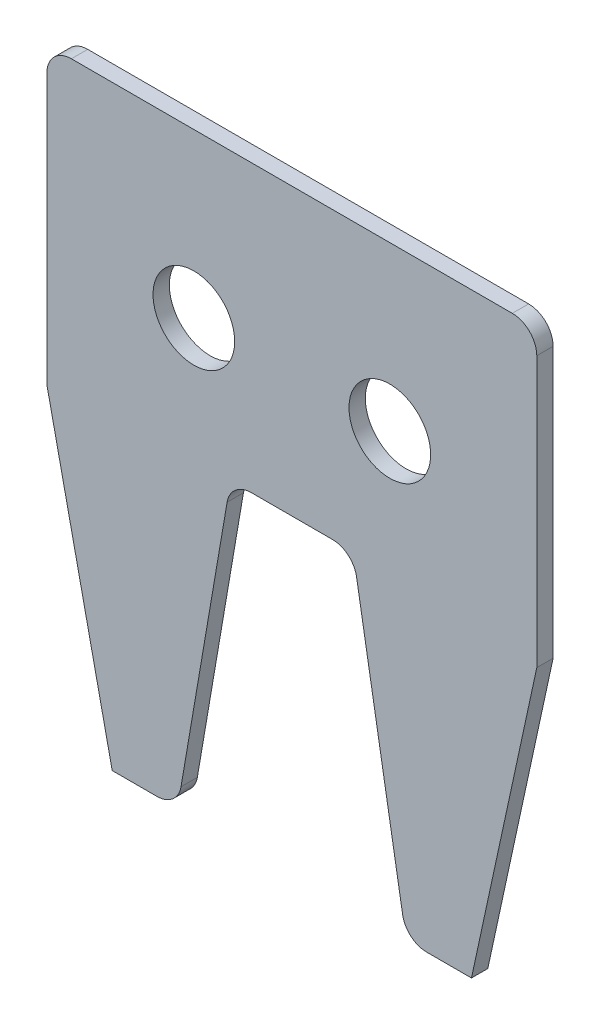
ISO-10303-21;
HEADER;
FILE_DESCRIPTION(('STEP AP214'),'2;1');
FILE_NAME('part.step','',(''),(''),'','','');
FILE_SCHEMA(('AUTOMOTIVE_DESIGN { 1 0 10303 214 1 1 1 1 }'));
ENDSEC;
DATA;
#1=APPLICATION_CONTEXT('core data for automotive mechanical design processes');
#2=APPLICATION_PROTOCOL_DEFINITION('international standard','automotive_design',2000,#1);
#3=PRODUCT_CONTEXT('',#1,'mechanical');
#4=PRODUCT('Part','Part','',(#3));
#5=PRODUCT_RELATED_PRODUCT_CATEGORY('part','',(#4));
#6=PRODUCT_DEFINITION_FORMATION('','',#4);
#7=PRODUCT_DEFINITION_CONTEXT('part definition',#1,'design');
#8=PRODUCT_DEFINITION('design','',#6,#7);
#9=PRODUCT_DEFINITION_SHAPE('','',#8);
#10=(LENGTH_UNIT() NAMED_UNIT(*) SI_UNIT(.MILLI.,.METRE.));
#11=(NAMED_UNIT(*) PLANE_ANGLE_UNIT() SI_UNIT($,.RADIAN.));
#12=(NAMED_UNIT(*) SI_UNIT($,.STERADIAN.) SOLID_ANGLE_UNIT());
#13=UNCERTAINTY_MEASURE_WITH_UNIT(LENGTH_MEASURE(1.E-05),#10,'distance_accuracy_value','');
#14=(GEOMETRIC_REPRESENTATION_CONTEXT(3) GLOBAL_UNCERTAINTY_ASSIGNED_CONTEXT((#13)) GLOBAL_UNIT_ASSIGNED_CONTEXT((#10,
#11,#12)) REPRESENTATION_CONTEXT('',''));
#15=CARTESIAN_POINT('',(0.,0.,0.));
#16=DIRECTION('',(0.,0.,1.));
#17=DIRECTION('',(1.,0.,0.));
#18=AXIS2_PLACEMENT_3D('',#15,#16,#17);
#19=CARTESIAN_POINT('',(-30.,-812.,32.));
#20=DIRECTION('',(0.,1.,0.));
#21=DIRECTION('',(0.,0.,1.));
#22=AXIS2_PLACEMENT_3D('',#19,#20,#21);
#23=PLANE('',#22);
#24=DIRECTION('',(1.,0.,0.));
#25=VECTOR('',#24,1.);
#26=CARTESIAN_POINT('',(-30.,-812.,30.));
#27=LINE('',#26,#25);
#28=CARTESIAN_POINT('',(-22.,-812.,30.));
#29=VERTEX_POINT('',#28);
#30=CARTESIAN_POINT('',(-16.5304141883476,-812.,30.));
#31=VERTEX_POINT('',#30);
#32=EDGE_CURVE('E166',#29,#31,#27,.T.);
#33=ORIENTED_EDGE('',*,*,#32,.T.);
#34=DIRECTION('',(0.,0.,1.));
#35=VECTOR('',#34,1.);
#36=CARTESIAN_POINT('',(-16.5304141883476,-812.,32.));
#37=LINE('',#36,#35);
#38=CARTESIAN_POINT('',(-16.5304141883476,-812.,32.));
#39=VERTEX_POINT('',#38);
#40=EDGE_CURVE('E207',#31,#39,#37,.T.);
#41=ORIENTED_EDGE('',*,*,#40,.T.);
#42=DIRECTION('',(1.,0.,0.));
#43=VECTOR('',#42,1.);
#44=CARTESIAN_POINT('',(-30.,-812.,32.));
#45=LINE('',#44,#43);
#46=CARTESIAN_POINT('',(-22.,-812.,32.));
#47=VERTEX_POINT('',#46);
#48=EDGE_CURVE('E169',#47,#39,#45,.T.);
#49=ORIENTED_EDGE('',*,*,#48,.F.);
#50=DIRECTION('',(0.,0.,1.));
#51=VECTOR('',#50,1.);
#52=CARTESIAN_POINT('',(-22.,-812.,-180.001));
#53=LINE('',#52,#51);
#54=EDGE_CURVE('E156',#29,#47,#53,.T.);
#55=ORIENTED_EDGE('',*,*,#54,.F.);
#56=EDGE_LOOP('',(#33,#41,#49,#55));
#57=FACE_BOUND('',#56,.T.);
#58=ADVANCED_FACE('F37',(#57),#23,.F.);
#59=CARTESIAN_POINT('',(30.,-812.,32.));
#60=DIRECTION('',(-1.,0.,0.));
#61=DIRECTION('',(0.,-1.,0.));
#62=AXIS2_PLACEMENT_3D('',#59,#60,#61);
#63=PLANE('',#62);
#64=DIRECTION('',(0.,1.,0.));
#65=VECTOR('',#64,1.);
#66=CARTESIAN_POINT('',(30.,-812.,30.));
#67=LINE('',#66,#65);
#68=CARTESIAN_POINT('',(30.,-775.076541071305,30.));
#69=VERTEX_POINT('',#68);
#70=CARTESIAN_POINT('',(30.,-742.,30.));
#71=VERTEX_POINT('',#70);
#72=EDGE_CURVE('E161',#69,#71,#67,.T.);
#73=ORIENTED_EDGE('',*,*,#72,.T.);
#74=DIRECTION('',(0.,0.,-1.));
#75=VECTOR('',#74,1.);
#76=CARTESIAN_POINT('',(30.,-742.,32.));
#77=LINE('',#76,#75);
#78=CARTESIAN_POINT('',(30.,-742.,32.));
#79=VERTEX_POINT('',#78);
#80=EDGE_CURVE('E223',#71,#79,#77,.F.);
#81=ORIENTED_EDGE('',*,*,#80,.T.);
#82=DIRECTION('',(0.,1.,0.));
#83=VECTOR('',#82,1.);
#84=CARTESIAN_POINT('',(30.,-812.,32.));
#85=LINE('',#84,#83);
#86=CARTESIAN_POINT('',(30.,-775.076541071305,32.));
#87=VERTEX_POINT('',#86);
#88=EDGE_CURVE('E175',#87,#79,#85,.T.);
#89=ORIENTED_EDGE('',*,*,#88,.F.);
#90=DIRECTION('',(0.,0.,1.));
#91=VECTOR('',#90,1.);
#92=CARTESIAN_POINT('',(30.,-775.076541071305,-180.001));
#93=LINE('',#92,#91);
#94=EDGE_CURVE('E273',#69,#87,#93,.T.);
#95=ORIENTED_EDGE('',*,*,#94,.F.);
#96=EDGE_LOOP('',(#73,#81,#89,#95));
#97=FACE_BOUND('',#96,.T.);
#98=ADVANCED_FACE('F313',(#97),#63,.F.);
#99=CARTESIAN_POINT('',(-30.,-739.,32.));
#100=DIRECTION('',(0.,-1.,0.));
#101=DIRECTION('',(0.,0.,-1.));
#102=AXIS2_PLACEMENT_3D('',#99,#100,#101);
#103=PLANE('',#102);
#104=DIRECTION('',(-1.,0.,0.));
#105=VECTOR('',#104,1.);
#106=CARTESIAN_POINT('',(-30.,-739.,32.));
#107=LINE('',#106,#105);
#108=CARTESIAN_POINT('',(27.,-739.,32.));
#109=VERTEX_POINT('',#108);
#110=CARTESIAN_POINT('',(-27.,-739.,32.));
#111=VERTEX_POINT('',#110);
#112=EDGE_CURVE('E179',#109,#111,#107,.T.);
#113=ORIENTED_EDGE('',*,*,#112,.F.);
#114=DIRECTION('',(0.,0.,-1.));
#115=VECTOR('',#114,1.);
#116=CARTESIAN_POINT('',(27.,-739.,32.));
#117=LINE('',#116,#115);
#118=CARTESIAN_POINT('',(27.,-739.,30.));
#119=VERTEX_POINT('',#118);
#120=EDGE_CURVE('E220',#109,#119,#117,.T.);
#121=ORIENTED_EDGE('',*,*,#120,.T.);
#122=DIRECTION('',(-1.,0.,0.));
#123=VECTOR('',#122,1.);
#124=CARTESIAN_POINT('',(-30.,-739.,30.));
#125=LINE('',#124,#123);
#126=CARTESIAN_POINT('',(-27.,-739.,30.));
#127=VERTEX_POINT('',#126);
#128=EDGE_CURVE('E290',#119,#127,#125,.T.);
#129=ORIENTED_EDGE('',*,*,#128,.T.);
#130=DIRECTION('',(0.,0.,-1.));
#131=VECTOR('',#130,1.);
#132=CARTESIAN_POINT('',(-27.,-739.,32.));
#133=LINE('',#132,#131);
#134=EDGE_CURVE('E218',#127,#111,#133,.F.);
#135=ORIENTED_EDGE('',*,*,#134,.T.);
#136=EDGE_LOOP('',(#113,#121,#129,#135));
#137=FACE_BOUND('',#136,.T.);
#138=ADVANCED_FACE('F302',(#137),#103,.F.);
#139=CARTESIAN_POINT('',(-30.,-812.,32.));
#140=DIRECTION('',(1.,0.,0.));
#141=DIRECTION('',(0.,0.,-1.));
#142=AXIS2_PLACEMENT_3D('',#139,#140,#141);
#143=PLANE('',#142);
#144=DIRECTION('',(0.,-1.,0.));
#145=VECTOR('',#144,1.);
#146=CARTESIAN_POINT('',(-30.,-812.,32.));
#147=LINE('',#146,#145);
#148=CARTESIAN_POINT('',(-30.,-742.,32.));
#149=VERTEX_POINT('',#148);
#150=CARTESIAN_POINT('',(-30.,-775.076541071305,32.));
#151=VERTEX_POINT('',#150);
#152=EDGE_CURVE('E285',#149,#151,#147,.T.);
#153=ORIENTED_EDGE('',*,*,#152,.F.);
#154=DIRECTION('',(0.,0.,-1.));
#155=VECTOR('',#154,1.);
#156=CARTESIAN_POINT('',(-30.,-742.,32.));
#157=LINE('',#156,#155);
#158=CARTESIAN_POINT('',(-30.,-742.,30.));
#159=VERTEX_POINT('',#158);
#160=EDGE_CURVE('E225',#149,#159,#157,.T.);
#161=ORIENTED_EDGE('',*,*,#160,.T.);
#162=DIRECTION('',(0.,-1.,0.));
#163=VECTOR('',#162,1.);
#164=CARTESIAN_POINT('',(-30.,-812.,30.));
#165=LINE('',#164,#163);
#166=CARTESIAN_POINT('',(-29.9999999999993,-775.076541071311,30.));
#167=VERTEX_POINT('',#166);
#168=EDGE_CURVE('E181',#159,#167,#165,.T.);
#169=ORIENTED_EDGE('',*,*,#168,.T.);
#170=DIRECTION('',(0.,0.,1.));
#171=VECTOR('',#170,1.);
#172=CARTESIAN_POINT('',(-30.,-775.076541071305,-180.001));
#173=LINE('',#172,#171);
#174=EDGE_CURVE('E159',#167,#151,#173,.T.);
#175=ORIENTED_EDGE('',*,*,#174,.T.);
#176=EDGE_LOOP('',(#153,#161,#169,#175));
#177=FACE_BOUND('',#176,.T.);
#178=ADVANCED_FACE('F297',(#177),#143,.F.);
#179=CARTESIAN_POINT('',(16.5304141883476,-812.,32.));
#180=VERTEX_POINT('',#179);
#181=CARTESIAN_POINT('',(22.,-812.,32.));
#182=VERTEX_POINT('',#181);
#183=EDGE_CURVE('E287',#180,#182,#45,.T.);
#184=ORIENTED_EDGE('',*,*,#183,.F.);
#185=DIRECTION('',(0.,0.,1.));
#186=VECTOR('',#185,1.);
#187=CARTESIAN_POINT('',(16.5304141883476,-812.,32.));
#188=LINE('',#187,#186);
#189=CARTESIAN_POINT('',(16.5304141883476,-812.,30.));
#190=VERTEX_POINT('',#189);
#191=EDGE_CURVE('E198',#180,#190,#188,.F.);
#192=ORIENTED_EDGE('',*,*,#191,.T.);
#193=CARTESIAN_POINT('',(22.,-812.,30.));
#194=VERTEX_POINT('',#193);
#195=EDGE_CURVE('E176',#190,#194,#27,.T.);
#196=ORIENTED_EDGE('',*,*,#195,.T.);
#197=DIRECTION('',(0.,0.,1.));
#198=VECTOR('',#197,1.);
#199=CARTESIAN_POINT('',(22.,-812.,-180.001));
#200=LINE('',#199,#198);
#201=EDGE_CURVE('E272',#194,#182,#200,.T.);
#202=ORIENTED_EDGE('',*,*,#201,.T.);
#203=EDGE_LOOP('',(#184,#192,#196,#202));
#204=FACE_BOUND('',#203,.T.);
#205=ADVANCED_FACE('F320',(#204),#23,.F.);
#206=CARTESIAN_POINT('',(0.,0.,32.));
#207=DIRECTION('',(0.,0.,-1.));
#208=DIRECTION('',(-1.,0.,0.));
#209=AXIS2_PLACEMENT_3D('',#206,#207,#208);
#210=PLANE('',#209);
#211=CARTESIAN_POINT('',(12.,-759.,32.));
#212=DIRECTION('',(0.,0.,1.));
#213=DIRECTION('',(-1.,0.,0.));
#214=AXIS2_PLACEMENT_3D('',#211,#212,#213);
#215=CIRCLE('',#214,5.);
#216=CARTESIAN_POINT('',(7.,-759.,32.));
#217=VERTEX_POINT('',#216);
#218=EDGE_CURVE('E281',#217,#217,#215,.T.);
#219=ORIENTED_EDGE('',*,*,#218,.F.);
#220=EDGE_LOOP('',(#219));
#221=FACE_BOUND('',#220,.T.);
#222=CARTESIAN_POINT('',(-12.,-759.,32.));
#223=DIRECTION('',(0.,0.,1.));
#224=DIRECTION('',(1.,0.,0.));
#225=AXIS2_PLACEMENT_3D('',#222,#223,#224);
#226=CIRCLE('',#225,5.);
#227=CARTESIAN_POINT('',(-7.,-759.,32.));
#228=VERTEX_POINT('',#227);
#229=EDGE_CURVE('E269',#228,#228,#226,.T.);
#230=ORIENTED_EDGE('',*,*,#229,.F.);
#231=EDGE_LOOP('',(#230));
#232=FACE_BOUND('',#231,.T.);
#233=DIRECTION('',(-0.168603824955839,0.985683899741829,0.));
#234=VECTOR('',#233,1.);
#235=CARTESIAN_POINT('',(14.,-812.,32.));
#236=LINE('',#235,#234);
#237=CARTESIAN_POINT('',(13.5733624891221,-809.505811474868,32.));
#238=VERTEX_POINT('',#237);
#239=CARTESIAN_POINT('',(7.92663751087793,-776.494188525132,32.));
#240=VERTEX_POINT('',#239);
#241=EDGE_CURVE('E247',#238,#240,#236,.T.);
#242=ORIENTED_EDGE('',*,*,#241,.F.);
#243=CARTESIAN_POINT('',(16.5304141883476,-809.,32.));
#244=DIRECTION('',(0.,0.,-1.));
#245=DIRECTION('',(-1.,0.,0.));
#246=AXIS2_PLACEMENT_3D('',#243,#244,#245);
#247=CIRCLE('',#246,3.);
#248=EDGE_CURVE('E196',#238,#180,#247,.F.);
#249=ORIENTED_EDGE('',*,*,#248,.T.);
#250=ORIENTED_EDGE('',*,*,#183,.T.);
#251=DIRECTION('',(-0.211751254463143,-0.977323593408696,0.));
#252=VECTOR('',#251,1.);
#253=CARTESIAN_POINT('',(30.,-775.076541071305,32.));
#254=LINE('',#253,#252);
#255=EDGE_CURVE('E268',#87,#182,#254,.T.);
#256=ORIENTED_EDGE('',*,*,#255,.F.);
#257=ORIENTED_EDGE('',*,*,#88,.T.);
#258=CARTESIAN_POINT('',(27.,-742.,32.));
#259=DIRECTION('',(0.,0.,-1.));
#260=DIRECTION('',(-1.,0.,0.));
#261=AXIS2_PLACEMENT_3D('',#258,#259,#260);
#262=CIRCLE('',#261,3.);
#263=EDGE_CURVE('E192',#79,#109,#262,.F.);
#264=ORIENTED_EDGE('',*,*,#263,.T.);
#265=ORIENTED_EDGE('',*,*,#112,.T.);
#266=CARTESIAN_POINT('',(-27.,-742.,32.));
#267=DIRECTION('',(0.,0.,-1.));
#268=DIRECTION('',(-1.,0.,0.));
#269=AXIS2_PLACEMENT_3D('',#266,#267,#268);
#270=CIRCLE('',#269,3.);
#271=EDGE_CURVE('E190',#111,#149,#270,.F.);
#272=ORIENTED_EDGE('',*,*,#271,.T.);
#273=ORIENTED_EDGE('',*,*,#152,.T.);
#274=DIRECTION('',(-0.211751254463143,0.977323593408696,0.));
#275=VECTOR('',#274,1.);
#276=CARTESIAN_POINT('',(-30.,-775.076541071305,32.));
#277=LINE('',#276,#275);
#278=EDGE_CURVE('E170',#47,#151,#277,.T.);
#279=ORIENTED_EDGE('',*,*,#278,.F.);
#280=ORIENTED_EDGE('',*,*,#48,.T.);
#281=CARTESIAN_POINT('',(-16.5304141883476,-809.,32.));
#282=DIRECTION('',(0.,0.,-1.));
#283=DIRECTION('',(-1.,0.,0.));
#284=AXIS2_PLACEMENT_3D('',#281,#282,#283);
#285=CIRCLE('',#284,3.);
#286=CARTESIAN_POINT('',(-13.5733624891221,-809.505811474868,32.));
#287=VERTEX_POINT('',#286);
#288=EDGE_CURVE('E194',#39,#287,#285,.F.);
#289=ORIENTED_EDGE('',*,*,#288,.T.);
#290=DIRECTION('',(-0.168603824955839,-0.985683899741829,0.));
#291=VECTOR('',#290,1.);
#292=CARTESIAN_POINT('',(-14.,-812.,32.));
#293=LINE('',#292,#291);
#294=CARTESIAN_POINT('',(-7.92663751087793,-776.494188525132,32.));
#295=VERTEX_POINT('',#294);
#296=EDGE_CURVE('E238',#295,#287,#293,.T.);
#297=ORIENTED_EDGE('',*,*,#296,.F.);
#298=CARTESIAN_POINT('',(-4.96958581165244,-777.,32.));
#299=DIRECTION('',(0.,0.,-1.));
#300=DIRECTION('',(-1.,0.,0.));
#301=AXIS2_PLACEMENT_3D('',#298,#299,#300);
#302=CIRCLE('',#301,3.);
#303=CARTESIAN_POINT('',(-4.96958581165244,-774.,32.));
#304=VERTEX_POINT('',#303);
#305=EDGE_CURVE('E45',#295,#304,#302,.T.);
#306=ORIENTED_EDGE('',*,*,#305,.T.);
#307=DIRECTION('',(-1.,0.,0.));
#308=VECTOR('',#307,1.);
#309=CARTESIAN_POINT('',(7.5,-774.,32.));
#310=LINE('',#309,#308);
#311=CARTESIAN_POINT('',(4.96958581165244,-774.,32.));
#312=VERTEX_POINT('',#311);
#313=EDGE_CURVE('E237',#312,#304,#310,.T.);
#314=ORIENTED_EDGE('',*,*,#313,.F.);
#315=CARTESIAN_POINT('',(4.96958581165244,-777.,32.));
#316=DIRECTION('',(0.,0.,-1.));
#317=DIRECTION('',(-1.,0.,0.));
#318=AXIS2_PLACEMENT_3D('',#315,#316,#317);
#319=CIRCLE('',#318,3.);
#320=EDGE_CURVE('E228',#312,#240,#319,.T.);
#321=ORIENTED_EDGE('',*,*,#320,.T.);
#322=EDGE_LOOP('',(#242,#249,#250,#256,#257,#264,#265,#272,#273,#279,#280,#289,#297,#306,#314,#321));
#323=FACE_BOUND('',#322,.T.);
#324=ADVANCED_FACE('F236',(#221,#232,#323),#210,.F.);
#325=CARTESIAN_POINT('',(0.,0.,30.));
#326=DIRECTION('',(0.,0.,-1.));
#327=DIRECTION('',(-1.,0.,0.));
#328=AXIS2_PLACEMENT_3D('',#325,#326,#327);
#329=PLANE('',#328);
#330=ORIENTED_EDGE('',*,*,#195,.F.);
#331=CARTESIAN_POINT('',(16.5304141883476,-809.,30.));
#332=DIRECTION('',(0.,0.,-1.));
#333=DIRECTION('',(-1.,0.,0.));
#334=AXIS2_PLACEMENT_3D('',#331,#332,#333);
#335=CIRCLE('',#334,3.);
#336=CARTESIAN_POINT('',(13.5733624891221,-809.505811474868,30.));
#337=VERTEX_POINT('',#336);
#338=EDGE_CURVE('E205',#190,#337,#335,.T.);
#339=ORIENTED_EDGE('',*,*,#338,.T.);
#340=DIRECTION('',(-0.168603824955839,0.985683899741829,0.));
#341=VECTOR('',#340,1.);
#342=CARTESIAN_POINT('',(14.,-812.,30.));
#343=LINE('',#342,#341);
#344=CARTESIAN_POINT('',(7.92663751087793,-776.494188525132,30.));
#345=VERTEX_POINT('',#344);
#346=EDGE_CURVE('E261',#337,#345,#343,.T.);
#347=ORIENTED_EDGE('',*,*,#346,.T.);
#348=CARTESIAN_POINT('',(4.96958581165244,-777.,30.));
#349=DIRECTION('',(0.,0.,-1.));
#350=DIRECTION('',(-1.,0.,0.));
#351=AXIS2_PLACEMENT_3D('',#348,#349,#350);
#352=CIRCLE('',#351,3.);
#353=CARTESIAN_POINT('',(4.96958581165244,-774.,30.));
#354=VERTEX_POINT('',#353);
#355=EDGE_CURVE('E230',#345,#354,#352,.F.);
#356=ORIENTED_EDGE('',*,*,#355,.T.);
#357=DIRECTION('',(-1.,0.,0.));
#358=VECTOR('',#357,1.);
#359=CARTESIAN_POINT('',(7.5,-774.,30.));
#360=LINE('',#359,#358);
#361=CARTESIAN_POINT('',(-4.96958581165244,-774.,30.));
#362=VERTEX_POINT('',#361);
#363=EDGE_CURVE('E252',#354,#362,#360,.T.);
#364=ORIENTED_EDGE('',*,*,#363,.T.);
#365=CARTESIAN_POINT('',(-4.96958581165244,-777.,30.));
#366=DIRECTION('',(0.,0.,-1.));
#367=DIRECTION('',(-1.,0.,0.));
#368=AXIS2_PLACEMENT_3D('',#365,#366,#367);
#369=CIRCLE('',#368,3.);
#370=CARTESIAN_POINT('',(-7.92663751087793,-776.494188525132,30.));
#371=VERTEX_POINT('',#370);
#372=EDGE_CURVE('E11',#362,#371,#369,.F.);
#373=ORIENTED_EDGE('',*,*,#372,.T.);
#374=DIRECTION('',(-0.168603824955839,-0.985683899741829,0.));
#375=VECTOR('',#374,1.);
#376=CARTESIAN_POINT('',(-14.,-812.,30.));
#377=LINE('',#376,#375);
#378=CARTESIAN_POINT('',(-13.5733624891221,-809.505811474868,30.));
#379=VERTEX_POINT('',#378);
#380=EDGE_CURVE('E251',#371,#379,#377,.T.);
#381=ORIENTED_EDGE('',*,*,#380,.T.);
#382=CARTESIAN_POINT('',(-16.5304141883476,-809.,30.));
#383=DIRECTION('',(0.,0.,-1.));
#384=DIRECTION('',(-1.,0.,0.));
#385=AXIS2_PLACEMENT_3D('',#382,#383,#384);
#386=CIRCLE('',#385,3.);
#387=EDGE_CURVE('E52',#379,#31,#386,.T.);
#388=ORIENTED_EDGE('',*,*,#387,.T.);
#389=ORIENTED_EDGE('',*,*,#32,.F.);
#390=DIRECTION('',(-0.211751254463143,0.977323593408696,0.));
#391=VECTOR('',#390,1.);
#392=CARTESIAN_POINT('',(-30.,-775.076541071305,30.));
#393=LINE('',#392,#391);
#394=EDGE_CURVE('E152',#29,#167,#393,.T.);
#395=ORIENTED_EDGE('',*,*,#394,.T.);
#396=ORIENTED_EDGE('',*,*,#168,.F.);
#397=CARTESIAN_POINT('',(-27.,-742.,30.));
#398=DIRECTION('',(0.,0.,-1.));
#399=DIRECTION('',(-1.,0.,0.));
#400=AXIS2_PLACEMENT_3D('',#397,#398,#399);
#401=CIRCLE('',#400,3.);
#402=EDGE_CURVE('E200',#159,#127,#401,.T.);
#403=ORIENTED_EDGE('',*,*,#402,.T.);
#404=ORIENTED_EDGE('',*,*,#128,.F.);
#405=CARTESIAN_POINT('',(27.,-742.,30.));
#406=DIRECTION('',(0.,0.,-1.));
#407=DIRECTION('',(-1.,0.,0.));
#408=AXIS2_PLACEMENT_3D('',#405,#406,#407);
#409=CIRCLE('',#408,3.);
#410=EDGE_CURVE('E202',#119,#71,#409,.T.);
#411=ORIENTED_EDGE('',*,*,#410,.T.);
#412=ORIENTED_EDGE('',*,*,#72,.F.);
#413=DIRECTION('',(-0.211751254463143,-0.977323593408696,0.));
#414=VECTOR('',#413,1.);
#415=CARTESIAN_POINT('',(30.,-775.076541071305,30.));
#416=LINE('',#415,#414);
#417=EDGE_CURVE('E265',#69,#194,#416,.T.);
#418=ORIENTED_EDGE('',*,*,#417,.T.);
#419=EDGE_LOOP('',(#330,#339,#347,#356,#364,#373,#381,#388,#389,#395,#396,#403,#404,#411,#412,#418));
#420=FACE_BOUND('',#419,.T.);
#421=CARTESIAN_POINT('',(12.,-759.,30.));
#422=DIRECTION('',(0.,0.,-1.));
#423=DIRECTION('',(-1.,0.,0.));
#424=AXIS2_PLACEMENT_3D('',#421,#422,#423);
#425=CIRCLE('',#424,5.);
#426=CARTESIAN_POINT('',(7.,-759.,30.));
#427=VERTEX_POINT('',#426);
#428=EDGE_CURVE('E264',#427,#427,#425,.F.);
#429=ORIENTED_EDGE('',*,*,#428,.T.);
#430=EDGE_LOOP('',(#429));
#431=FACE_BOUND('',#430,.T.);
#432=CARTESIAN_POINT('',(-12.,-759.,30.));
#433=DIRECTION('',(0.,0.,-1.));
#434=DIRECTION('',(-1.,0.,0.));
#435=AXIS2_PLACEMENT_3D('',#432,#433,#434);
#436=CIRCLE('',#435,5.);
#437=CARTESIAN_POINT('',(-17.,-759.,30.));
#438=VERTEX_POINT('',#437);
#439=EDGE_CURVE('E279',#438,#438,#436,.F.);
#440=ORIENTED_EDGE('',*,*,#439,.T.);
#441=EDGE_LOOP('',(#440));
#442=FACE_BOUND('',#441,.T.);
#443=ADVANCED_FACE('F173',(#420,#431,#442),#329,.T.);
#444=CARTESIAN_POINT('',(30.,-775.076541071305,-180.001));
#445=DIRECTION('',(-0.977323593408695,0.211751254463143,0.));
#446=DIRECTION('',(-0.211751254463143,-0.977323593408696,0.));
#447=AXIS2_PLACEMENT_3D('',#444,#445,#446);
#448=PLANE('',#447);
#449=ORIENTED_EDGE('',*,*,#94,.T.);
#450=ORIENTED_EDGE('',*,*,#255,.T.);
#451=ORIENTED_EDGE('',*,*,#201,.F.);
#452=ORIENTED_EDGE('',*,*,#417,.F.);
#453=EDGE_LOOP('',(#449,#450,#451,#452));
#454=FACE_BOUND('',#453,.T.);
#455=ADVANCED_FACE('F315',(#454),#448,.F.);
#456=CARTESIAN_POINT('',(-12.,-759.,-180.001));
#457=DIRECTION('',(0.,0.,1.));
#458=DIRECTION('',(1.,0.,0.));
#459=AXIS2_PLACEMENT_3D('',#456,#457,#458);
#460=CYLINDRICAL_SURFACE('',#459,5.);
#461=ORIENTED_EDGE('',*,*,#439,.F.);
#462=EDGE_LOOP('',(#461));
#463=FACE_BOUND('',#462,.T.);
#464=ORIENTED_EDGE('',*,*,#229,.T.);
#465=EDGE_LOOP('',(#464));
#466=FACE_BOUND('',#465,.T.);
#467=ADVANCED_FACE('F375',(#463,#466),#460,.F.);
#468=CARTESIAN_POINT('',(12.,-759.,-180.001));
#469=DIRECTION('',(0.,0.,1.));
#470=DIRECTION('',(1.,0.,0.));
#471=AXIS2_PLACEMENT_3D('',#468,#469,#470);
#472=CYLINDRICAL_SURFACE('',#471,5.);
#473=ORIENTED_EDGE('',*,*,#428,.F.);
#474=EDGE_LOOP('',(#473));
#475=FACE_BOUND('',#474,.T.);
#476=ORIENTED_EDGE('',*,*,#218,.T.);
#477=EDGE_LOOP('',(#476));
#478=FACE_BOUND('',#477,.T.);
#479=ADVANCED_FACE('F372',(#475,#478),#472,.F.);
#480=CARTESIAN_POINT('',(-14.,-812.,-180.001));
#481=DIRECTION('',(-0.985683899741829,0.168603824955839,0.));
#482=DIRECTION('',(-0.168603824955839,-0.985683899741829,0.));
#483=AXIS2_PLACEMENT_3D('',#480,#481,#482);
#484=PLANE('',#483);
#485=ORIENTED_EDGE('',*,*,#296,.T.);
#486=DIRECTION('',(0.,0.,1.));
#487=VECTOR('',#486,1.);
#488=CARTESIAN_POINT('',(-13.5733624891221,-809.505811474868,-180.001));
#489=LINE('',#488,#487);
#490=EDGE_CURVE('E60',#287,#379,#489,.F.);
#491=ORIENTED_EDGE('',*,*,#490,.T.);
#492=ORIENTED_EDGE('',*,*,#380,.F.);
#493=DIRECTION('',(0.,0.,1.));
#494=VECTOR('',#493,1.);
#495=CARTESIAN_POINT('',(-7.92663751087793,-776.494188525132,32.));
#496=LINE('',#495,#494);
#497=EDGE_CURVE('E209',#371,#295,#496,.T.);
#498=ORIENTED_EDGE('',*,*,#497,.T.);
#499=EDGE_LOOP('',(#485,#491,#492,#498));
#500=FACE_BOUND('',#499,.T.);
#501=ADVANCED_FACE('F253',(#500),#484,.F.);
#502=CARTESIAN_POINT('',(7.5,-774.,-180.001));
#503=DIRECTION('',(0.,1.,0.));
#504=DIRECTION('',(0.,0.,1.));
#505=AXIS2_PLACEMENT_3D('',#502,#503,#504);
#506=PLANE('',#505);
#507=ORIENTED_EDGE('',*,*,#363,.F.);
#508=DIRECTION('',(0.,0.,1.));
#509=VECTOR('',#508,1.);
#510=CARTESIAN_POINT('',(4.96958581165244,-774.,32.));
#511=LINE('',#510,#509);
#512=EDGE_CURVE('E215',#354,#312,#511,.T.);
#513=ORIENTED_EDGE('',*,*,#512,.T.);
#514=ORIENTED_EDGE('',*,*,#313,.T.);
#515=DIRECTION('',(0.,0.,1.));
#516=VECTOR('',#515,1.);
#517=CARTESIAN_POINT('',(-4.96958581165244,-774.,30.));
#518=LINE('',#517,#516);
#519=EDGE_CURVE('E213',#304,#362,#518,.F.);
#520=ORIENTED_EDGE('',*,*,#519,.T.);
#521=EDGE_LOOP('',(#507,#513,#514,#520));
#522=FACE_BOUND('',#521,.T.);
#523=ADVANCED_FACE('F244',(#522),#506,.F.);
#524=CARTESIAN_POINT('',(14.,-812.,-180.001));
#525=DIRECTION('',(0.985683899741829,0.168603824955839,0.));
#526=DIRECTION('',(-0.168603824955839,0.985683899741829,0.));
#527=AXIS2_PLACEMENT_3D('',#524,#525,#526);
#528=PLANE('',#527);
#529=ORIENTED_EDGE('',*,*,#346,.F.);
#530=DIRECTION('',(0.,0.,1.));
#531=VECTOR('',#530,1.);
#532=CARTESIAN_POINT('',(13.5733624891221,-809.505811474868,-180.001));
#533=LINE('',#532,#531);
#534=EDGE_CURVE('E187',#337,#238,#533,.T.);
#535=ORIENTED_EDGE('',*,*,#534,.T.);
#536=ORIENTED_EDGE('',*,*,#241,.T.);
#537=DIRECTION('',(0.,0.,1.));
#538=VECTOR('',#537,1.);
#539=CARTESIAN_POINT('',(7.92663751087793,-776.494188525132,30.));
#540=LINE('',#539,#538);
#541=EDGE_CURVE('E185',#240,#345,#540,.F.);
#542=ORIENTED_EDGE('',*,*,#541,.T.);
#543=EDGE_LOOP('',(#529,#535,#536,#542));
#544=FACE_BOUND('',#543,.T.);
#545=ADVANCED_FACE('F328',(#544),#528,.F.);
#546=CARTESIAN_POINT('',(-30.,-775.076541071305,-180.001));
#547=DIRECTION('',(0.977323593408695,0.211751254463143,0.));
#548=DIRECTION('',(-0.211751254463143,0.977323593408696,0.));
#549=AXIS2_PLACEMENT_3D('',#546,#547,#548);
#550=PLANE('',#549);
#551=ORIENTED_EDGE('',*,*,#54,.T.);
#552=ORIENTED_EDGE('',*,*,#278,.T.);
#553=ORIENTED_EDGE('',*,*,#174,.F.);
#554=ORIENTED_EDGE('',*,*,#394,.F.);
#555=EDGE_LOOP('',(#551,#552,#553,#554));
#556=FACE_BOUND('',#555,.T.);
#557=ADVANCED_FACE('F154',(#556),#550,.F.);
#558=CARTESIAN_POINT('',(16.5304141883476,-809.,-180.001));
#559=DIRECTION('',(0.,0.,1.));
#560=DIRECTION('',(1.,0.,0.));
#561=AXIS2_PLACEMENT_3D('',#558,#559,#560);
#562=CYLINDRICAL_SURFACE('',#561,3.);
#563=ORIENTED_EDGE('',*,*,#338,.F.);
#564=ORIENTED_EDGE('',*,*,#191,.F.);
#565=ORIENTED_EDGE('',*,*,#248,.F.);
#566=ORIENTED_EDGE('',*,*,#534,.F.);
#567=EDGE_LOOP('',(#563,#564,#565,#566));
#568=FACE_BOUND('',#567,.T.);
#569=ADVANCED_FACE('F323',(#568),#562,.T.);
#570=CARTESIAN_POINT('',(-16.5304141883476,-809.,32.));
#571=DIRECTION('',(0.,0.,1.));
#572=DIRECTION('',(1.,0.,0.));
#573=AXIS2_PLACEMENT_3D('',#570,#571,#572);
#574=CYLINDRICAL_SURFACE('',#573,3.);
#575=ORIENTED_EDGE('',*,*,#387,.F.);
#576=ORIENTED_EDGE('',*,*,#490,.F.);
#577=ORIENTED_EDGE('',*,*,#288,.F.);
#578=ORIENTED_EDGE('',*,*,#40,.F.);
#579=EDGE_LOOP('',(#575,#576,#577,#578));
#580=FACE_BOUND('',#579,.T.);
#581=ADVANCED_FACE('F333',(#580),#574,.T.);
#582=CARTESIAN_POINT('',(4.96958581165244,-777.,-180.001));
#583=DIRECTION('',(0.,0.,-1.));
#584=DIRECTION('',(-1.,0.,0.));
#585=AXIS2_PLACEMENT_3D('',#582,#583,#584);
#586=CYLINDRICAL_SURFACE('',#585,3.);
#587=ORIENTED_EDGE('',*,*,#355,.F.);
#588=ORIENTED_EDGE('',*,*,#541,.F.);
#589=ORIENTED_EDGE('',*,*,#320,.F.);
#590=ORIENTED_EDGE('',*,*,#512,.F.);
#591=EDGE_LOOP('',(#587,#588,#589,#590));
#592=FACE_BOUND('',#591,.T.);
#593=ADVANCED_FACE('F331',(#592),#586,.F.);
#594=CARTESIAN_POINT('',(-4.96958581165244,-777.,-180.001));
#595=DIRECTION('',(0.,0.,-1.));
#596=DIRECTION('',(-1.,0.,0.));
#597=AXIS2_PLACEMENT_3D('',#594,#595,#596);
#598=CYLINDRICAL_SURFACE('',#597,3.);
#599=ORIENTED_EDGE('',*,*,#372,.F.);
#600=ORIENTED_EDGE('',*,*,#519,.F.);
#601=ORIENTED_EDGE('',*,*,#305,.F.);
#602=ORIENTED_EDGE('',*,*,#497,.F.);
#603=EDGE_LOOP('',(#599,#600,#601,#602));
#604=FACE_BOUND('',#603,.T.);
#605=ADVANCED_FACE('F250',(#604),#598,.F.);
#606=CARTESIAN_POINT('',(27.,-742.,32.));
#607=DIRECTION('',(0.,0.,-1.));
#608=DIRECTION('',(-1.,0.,0.));
#609=AXIS2_PLACEMENT_3D('',#606,#607,#608);
#610=CYLINDRICAL_SURFACE('',#609,3.);
#611=ORIENTED_EDGE('',*,*,#263,.F.);
#612=ORIENTED_EDGE('',*,*,#80,.F.);
#613=ORIENTED_EDGE('',*,*,#410,.F.);
#614=ORIENTED_EDGE('',*,*,#120,.F.);
#615=EDGE_LOOP('',(#611,#612,#613,#614));
#616=FACE_BOUND('',#615,.T.);
#617=ADVANCED_FACE('F309',(#616),#610,.T.);
#618=CARTESIAN_POINT('',(-27.,-742.,32.));
#619=DIRECTION('',(0.,0.,-1.));
#620=DIRECTION('',(-1.,0.,0.));
#621=AXIS2_PLACEMENT_3D('',#618,#619,#620);
#622=CYLINDRICAL_SURFACE('',#621,3.);
#623=ORIENTED_EDGE('',*,*,#271,.F.);
#624=ORIENTED_EDGE('',*,*,#134,.F.);
#625=ORIENTED_EDGE('',*,*,#402,.F.);
#626=ORIENTED_EDGE('',*,*,#160,.F.);
#627=EDGE_LOOP('',(#623,#624,#625,#626));
#628=FACE_BOUND('',#627,.T.);
#629=ADVANCED_FACE('F39',(#628),#622,.T.);
#630=CLOSED_SHELL('',(#58,#98,#138,#178,#205,#324,#443,#455,#467,#479,#501,#523,#545,#557,#569,
#581,#593,#605,#617,#629));
#631=MANIFOLD_SOLID_BREP('B2',#630);
#632=ADVANCED_BREP_SHAPE_REPRESENTATION('',(#18,#631),#14);
#633=SHAPE_DEFINITION_REPRESENTATION(#9,#632);
ENDSEC;
END-ISO-10303-21;
